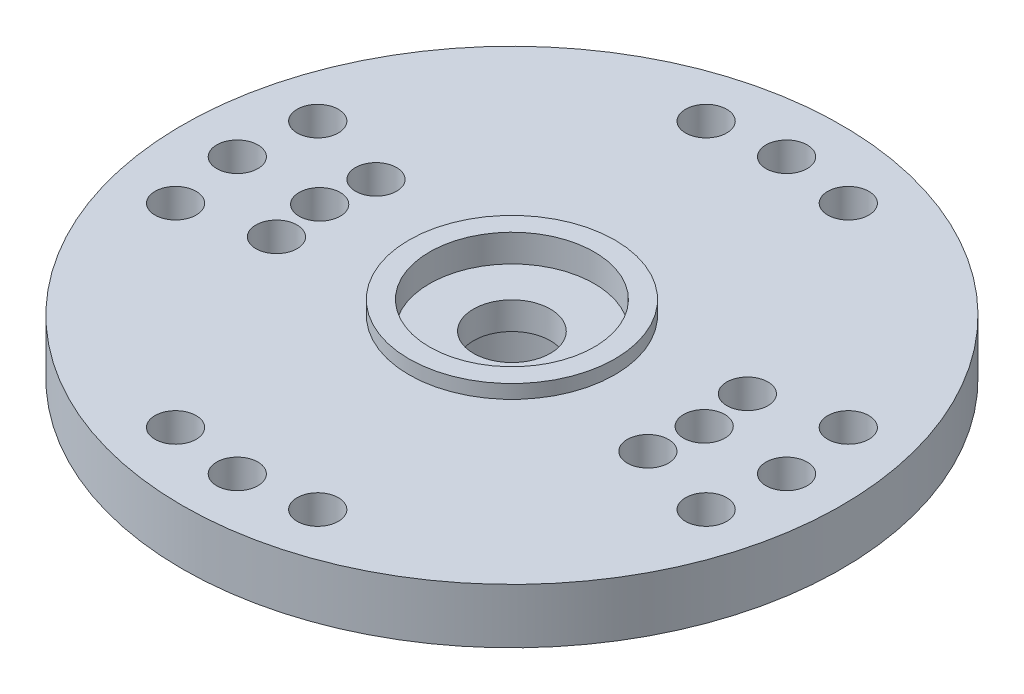
ISO-10303-21;
HEADER;
FILE_DESCRIPTION(('STEP AP214'),'2;1');
FILE_NAME('part.step','',(''),(''),'','','');
FILE_SCHEMA(('AUTOMOTIVE_DESIGN { 1 0 10303 214 1 1 1 1 }'));
ENDSEC;
DATA;
#1=APPLICATION_CONTEXT('core data for automotive mechanical design processes');
#2=APPLICATION_PROTOCOL_DEFINITION('international standard','automotive_design',2000,#1);
#3=PRODUCT_CONTEXT('',#1,'mechanical');
#4=PRODUCT('Part','Part','',(#3));
#5=PRODUCT_RELATED_PRODUCT_CATEGORY('part','',(#4));
#6=PRODUCT_DEFINITION_FORMATION('','',#4);
#7=PRODUCT_DEFINITION_CONTEXT('part definition',#1,'design');
#8=PRODUCT_DEFINITION('design','',#6,#7);
#9=PRODUCT_DEFINITION_SHAPE('','',#8);
#10=(LENGTH_UNIT() NAMED_UNIT(*) SI_UNIT(.MILLI.,.METRE.));
#11=(NAMED_UNIT(*) PLANE_ANGLE_UNIT() SI_UNIT($,.RADIAN.));
#12=(NAMED_UNIT(*) SI_UNIT($,.STERADIAN.) SOLID_ANGLE_UNIT());
#13=UNCERTAINTY_MEASURE_WITH_UNIT(LENGTH_MEASURE(1.E-05),#10,'distance_accuracy_value','');
#14=(GEOMETRIC_REPRESENTATION_CONTEXT(3) GLOBAL_UNCERTAINTY_ASSIGNED_CONTEXT((#13)) GLOBAL_UNIT_ASSIGNED_CONTEXT((#10,
#11,#12)) REPRESENTATION_CONTEXT('',''));
#15=CARTESIAN_POINT('',(0.,0.,0.));
#16=DIRECTION('',(0.,0.,1.));
#17=DIRECTION('',(1.,0.,0.));
#18=AXIS2_PLACEMENT_3D('',#15,#16,#17);
#19=CARTESIAN_POINT('',(0.,0.,0.));
#20=DIRECTION('',(0.,1.,0.));
#21=DIRECTION('',(0.,0.,1.));
#22=AXIS2_PLACEMENT_3D('',#19,#20,#21);
#23=CYLINDRICAL_SURFACE('',#22,1.4);
#24=CARTESIAN_POINT('',(0.,-0.5,0.));
#25=DIRECTION('',(0.,1.,0.));
#26=DIRECTION('',(0.,0.,1.));
#27=AXIS2_PLACEMENT_3D('',#24,#25,#26);
#28=CIRCLE('',#27,1.4);
#29=CARTESIAN_POINT('',(0.,-0.5,1.4));
#30=VERTEX_POINT('',#29);
#31=EDGE_CURVE('E58',#30,#30,#28,.T.);
#32=ORIENTED_EDGE('',*,*,#31,.T.);
#33=EDGE_LOOP('',(#32));
#34=FACE_BOUND('',#33,.T.);
#35=CARTESIAN_POINT('',(0.,-1.5,0.));
#36=DIRECTION('',(0.,-1.,0.));
#37=DIRECTION('',(0.,0.,-1.));
#38=AXIS2_PLACEMENT_3D('',#35,#36,#37);
#39=CIRCLE('',#38,1.4);
#40=CARTESIAN_POINT('',(0.,-1.5,-1.4));
#41=VERTEX_POINT('',#40);
#42=EDGE_CURVE('E42',#41,#41,#39,.T.);
#43=ORIENTED_EDGE('',*,*,#42,.T.);
#44=EDGE_LOOP('',(#43));
#45=FACE_BOUND('',#44,.T.);
#46=ADVANCED_FACE('F38',(#34,#45),#23,.F.);
#47=CARTESIAN_POINT('',(0.,0.,0.));
#48=DIRECTION('',(0.,1.,0.));
#49=DIRECTION('',(0.,0.,1.));
#50=AXIS2_PLACEMENT_3D('',#47,#48,#49);
#51=CYLINDRICAL_SURFACE('',#50,12.);
#52=CARTESIAN_POINT('',(0.,-2.,0.));
#53=DIRECTION('',(0.,1.,0.));
#54=DIRECTION('',(0.,0.,1.));
#55=AXIS2_PLACEMENT_3D('',#52,#53,#54);
#56=CIRCLE('',#55,12.);
#57=CARTESIAN_POINT('',(0.,-2.,12.));
#58=VERTEX_POINT('',#57);
#59=EDGE_CURVE('E10',#58,#58,#56,.T.);
#60=ORIENTED_EDGE('',*,*,#59,.T.);
#61=EDGE_LOOP('',(#60));
#62=FACE_BOUND('',#61,.T.);
#63=CARTESIAN_POINT('',(0.,0.,0.));
#64=DIRECTION('',(0.,1.,0.));
#65=DIRECTION('',(0.,0.,1.));
#66=AXIS2_PLACEMENT_3D('',#63,#64,#65);
#67=CIRCLE('',#66,12.);
#68=CARTESIAN_POINT('',(0.,0.,12.));
#69=VERTEX_POINT('',#68);
#70=EDGE_CURVE('E164',#69,#69,#67,.T.);
#71=ORIENTED_EDGE('',*,*,#70,.F.);
#72=EDGE_LOOP('',(#71));
#73=FACE_BOUND('',#72,.T.);
#74=ADVANCED_FACE('F40',(#62,#73),#51,.T.);
#75=CARTESIAN_POINT('',(-12.,-2.,0.));
#76=DIRECTION('',(0.,-1.,0.));
#77=DIRECTION('',(0.,0.,-1.));
#78=AXIS2_PLACEMENT_3D('',#75,#76,#77);
#79=PLANE('',#78);
#80=CARTESIAN_POINT('',(7.,-2.,0.));
#81=DIRECTION('',(0.,-1.,0.));
#82=DIRECTION('',(0.,0.,1.));
#83=AXIS2_PLACEMENT_3D('',#80,#81,#82);
#84=CIRCLE('',#83,0.749999999999993);
#85=CARTESIAN_POINT('',(7.00000000000001,-2.,0.749999999999944));
#86=VERTEX_POINT('',#85);
#87=EDGE_CURVE('E307',#86,#86,#84,.T.);
#88=ORIENTED_EDGE('',*,*,#87,.F.);
#89=EDGE_LOOP('',(#88));
#90=FACE_BOUND('',#89,.T.);
#91=CARTESIAN_POINT('',(6.76148078402348,-2.,-1.81173331571765));
#92=DIRECTION('',(0.,-1.,0.));
#93=DIRECTION('',(0.,0.,1.));
#94=AXIS2_PLACEMENT_3D('',#91,#92,#93);
#95=CIRCLE('',#94,0.749999999999993);
#96=CARTESIAN_POINT('',(6.76148078402348,-2.,-1.06173331571766));
#97=VERTEX_POINT('',#96);
#98=EDGE_CURVE('E315',#97,#97,#95,.T.);
#99=ORIENTED_EDGE('',*,*,#98,.F.);
#100=EDGE_LOOP('',(#99));
#101=FACE_BOUND('',#100,.T.);
#102=CARTESIAN_POINT('',(6.7614807840235,-2.,1.81173331571755));
#103=DIRECTION('',(0.,-1.,0.));
#104=DIRECTION('',(0.,0.,1.));
#105=AXIS2_PLACEMENT_3D('',#102,#103,#104);
#106=CIRCLE('',#105,0.749999999999993);
#107=CARTESIAN_POINT('',(6.76148078402351,-2.,2.56173331571755));
#108=VERTEX_POINT('',#107);
#109=EDGE_CURVE('E324',#108,#108,#106,.T.);
#110=ORIENTED_EDGE('',*,*,#109,.F.);
#111=EDGE_LOOP('',(#110));
#112=FACE_BOUND('',#111,.T.);
#113=CARTESIAN_POINT('',(-6.76148078402349,-2.,-1.8117333157176));
#114=DIRECTION('',(0.,-1.,0.));
#115=DIRECTION('',(0.,0.,-1.));
#116=AXIS2_PLACEMENT_3D('',#113,#114,#115);
#117=CIRCLE('',#116,0.749999999999993);
#118=CARTESIAN_POINT('',(-6.76148078402349,-2.,-2.56173331571759));
#119=VERTEX_POINT('',#118);
#120=EDGE_CURVE('E331',#119,#119,#117,.T.);
#121=ORIENTED_EDGE('',*,*,#120,.F.);
#122=EDGE_LOOP('',(#121));
#123=FACE_BOUND('',#122,.T.);
#124=CARTESIAN_POINT('',(-7.,-2.,0.));
#125=DIRECTION('',(0.,-1.,0.));
#126=DIRECTION('',(0.,0.,-1.));
#127=AXIS2_PLACEMENT_3D('',#124,#125,#126);
#128=CIRCLE('',#127,0.749999999999993);
#129=CARTESIAN_POINT('',(-7.,-2.,-0.749999999999993));
#130=VERTEX_POINT('',#129);
#131=EDGE_CURVE('E339',#130,#130,#128,.T.);
#132=ORIENTED_EDGE('',*,*,#131,.F.);
#133=EDGE_LOOP('',(#132));
#134=FACE_BOUND('',#133,.T.);
#135=CARTESIAN_POINT('',(-6.76148078402349,-2.,1.8117333157176));
#136=DIRECTION('',(0.,-1.,0.));
#137=DIRECTION('',(0.,0.,-1.));
#138=AXIS2_PLACEMENT_3D('',#135,#136,#137);
#139=CIRCLE('',#138,0.749999999999993);
#140=CARTESIAN_POINT('',(-6.76148078402349,-2.,1.06173331571761));
#141=VERTEX_POINT('',#140);
#142=EDGE_CURVE('E347',#141,#141,#139,.T.);
#143=ORIENTED_EDGE('',*,*,#142,.F.);
#144=EDGE_LOOP('',(#143));
#145=FACE_BOUND('',#144,.T.);
#146=CARTESIAN_POINT('',(-9.65925826289071,-2.,2.58819045102512));
#147=DIRECTION('',(0.,-1.,0.));
#148=DIRECTION('',(-1.,0.,0.));
#149=AXIS2_PLACEMENT_3D('',#146,#147,#148);
#150=CIRCLE('',#149,0.75);
#151=CARTESIAN_POINT('',(-10.4092582628907,-2.,2.58819045102511));
#152=VERTEX_POINT('',#151);
#153=EDGE_CURVE('E68',#152,#152,#150,.T.);
#154=ORIENTED_EDGE('',*,*,#153,.F.);
#155=EDGE_LOOP('',(#154));
#156=FACE_BOUND('',#155,.T.);
#157=CARTESIAN_POINT('',(2.58819045102515,-2.,9.6592582628907));
#158=DIRECTION('',(0.,-1.,0.));
#159=DIRECTION('',(0.,0.,1.));
#160=AXIS2_PLACEMENT_3D('',#157,#158,#159);
#161=CIRCLE('',#160,0.75);
#162=CARTESIAN_POINT('',(2.58819045102514,-2.,10.4092582628907));
#163=VERTEX_POINT('',#162);
#164=EDGE_CURVE('E88',#163,#163,#161,.T.);
#165=ORIENTED_EDGE('',*,*,#164,.F.);
#166=EDGE_LOOP('',(#165));
#167=FACE_BOUND('',#166,.T.);
#168=CARTESIAN_POINT('',(9.65925826289069,-2.,-2.58819045102518));
#169=DIRECTION('',(0.,-1.,0.));
#170=DIRECTION('',(1.,0.,0.));
#171=AXIS2_PLACEMENT_3D('',#168,#169,#170);
#172=CIRCLE('',#171,0.75);
#173=CARTESIAN_POINT('',(10.4092582628907,-2.,-2.58819045102518));
#174=VERTEX_POINT('',#173);
#175=EDGE_CURVE('E95',#174,#174,#172,.T.);
#176=ORIENTED_EDGE('',*,*,#175,.F.);
#177=EDGE_LOOP('',(#176));
#178=FACE_BOUND('',#177,.T.);
#179=CARTESIAN_POINT('',(-9.65925826289065,-2.,-2.58819045102531));
#180=DIRECTION('',(0.,-1.,0.));
#181=DIRECTION('',(-1.,0.,0.));
#182=AXIS2_PLACEMENT_3D('',#179,#180,#181);
#183=CIRCLE('',#182,0.75);
#184=CARTESIAN_POINT('',(-10.4092582628907,-2.,-2.58819045102532));
#185=VERTEX_POINT('',#184);
#186=EDGE_CURVE('E102',#185,#185,#183,.T.);
#187=ORIENTED_EDGE('',*,*,#186,.F.);
#188=EDGE_LOOP('',(#187));
#189=FACE_BOUND('',#188,.T.);
#190=CARTESIAN_POINT('',(-2.58819045102528,-2.,9.65925826289067));
#191=DIRECTION('',(0.,-1.,0.));
#192=DIRECTION('',(0.,0.,1.));
#193=AXIS2_PLACEMENT_3D('',#190,#191,#192);
#194=CIRCLE('',#193,0.75);
#195=CARTESIAN_POINT('',(-2.58819045102529,-2.,10.4092582628907));
#196=VERTEX_POINT('',#195);
#197=EDGE_CURVE('E109',#196,#196,#194,.T.);
#198=ORIENTED_EDGE('',*,*,#197,.F.);
#199=EDGE_LOOP('',(#198));
#200=FACE_BOUND('',#199,.T.);
#201=CARTESIAN_POINT('',(9.65925826289067,-2.,2.58819045102525));
#202=DIRECTION('',(0.,-1.,0.));
#203=DIRECTION('',(1.,0.,0.));
#204=AXIS2_PLACEMENT_3D('',#201,#202,#203);
#205=CIRCLE('',#204,0.75);
#206=CARTESIAN_POINT('',(10.4092582628907,-2.,2.58819045102525));
#207=VERTEX_POINT('',#206);
#208=EDGE_CURVE('E117',#207,#207,#205,.T.);
#209=ORIENTED_EDGE('',*,*,#208,.F.);
#210=EDGE_LOOP('',(#209));
#211=FACE_BOUND('',#210,.T.);
#212=CARTESIAN_POINT('',(-10.,-2.,-1.04744500833281E-13));
#213=DIRECTION('',(0.,-1.,0.));
#214=DIRECTION('',(-1.,0.,0.));
#215=AXIS2_PLACEMENT_3D('',#212,#213,#214);
#216=CIRCLE('',#215,0.75);
#217=CARTESIAN_POINT('',(-10.75,-2.,-1.12600338395778E-13));
#218=VERTEX_POINT('',#217);
#219=EDGE_CURVE('E123',#218,#218,#216,.T.);
#220=ORIENTED_EDGE('',*,*,#219,.F.);
#221=EDGE_LOOP('',(#220));
#222=FACE_BOUND('',#221,.T.);
#223=CARTESIAN_POINT('',(0.,-2.,10.));
#224=DIRECTION('',(0.,-1.,0.));
#225=DIRECTION('',(0.,0.,1.));
#226=AXIS2_PLACEMENT_3D('',#223,#224,#225);
#227=CIRCLE('',#226,0.75);
#228=CARTESIAN_POINT('',(0.,-2.,10.75));
#229=VERTEX_POINT('',#228);
#230=EDGE_CURVE('E130',#229,#229,#227,.T.);
#231=ORIENTED_EDGE('',*,*,#230,.F.);
#232=EDGE_LOOP('',(#231));
#233=FACE_BOUND('',#232,.T.);
#234=CARTESIAN_POINT('',(10.,-2.,0.));
#235=DIRECTION('',(0.,-1.,0.));
#236=DIRECTION('',(1.,0.,0.));
#237=AXIS2_PLACEMENT_3D('',#234,#235,#236);
#238=CIRCLE('',#237,0.75);
#239=CARTESIAN_POINT('',(10.75,-2.,0.));
#240=VERTEX_POINT('',#239);
#241=EDGE_CURVE('E138',#240,#240,#238,.T.);
#242=ORIENTED_EDGE('',*,*,#241,.F.);
#243=EDGE_LOOP('',(#242));
#244=FACE_BOUND('',#243,.T.);
#245=CARTESIAN_POINT('',(0.,-2.,-10.));
#246=DIRECTION('',(0.,-1.,0.));
#247=DIRECTION('',(0.,0.,-1.));
#248=AXIS2_PLACEMENT_3D('',#245,#246,#247);
#249=CIRCLE('',#248,0.75);
#250=CARTESIAN_POINT('',(0.,-2.,-10.75));
#251=VERTEX_POINT('',#250);
#252=EDGE_CURVE('E146',#251,#251,#249,.T.);
#253=ORIENTED_EDGE('',*,*,#252,.F.);
#254=EDGE_LOOP('',(#253));
#255=FACE_BOUND('',#254,.T.);
#256=CARTESIAN_POINT('',(-2.58819045102522,-2.,-9.65925826289068));
#257=DIRECTION('',(0.,-1.,0.));
#258=DIRECTION('',(0.,0.,-1.));
#259=AXIS2_PLACEMENT_3D('',#256,#257,#258);
#260=CIRCLE('',#259,0.75);
#261=CARTESIAN_POINT('',(-2.58819045102522,-2.,-10.4092582628907));
#262=VERTEX_POINT('',#261);
#263=EDGE_CURVE('E153',#262,#262,#260,.T.);
#264=ORIENTED_EDGE('',*,*,#263,.F.);
#265=EDGE_LOOP('',(#264));
#266=FACE_BOUND('',#265,.T.);
#267=CARTESIAN_POINT('',(2.58819045102521,-2.,-9.65925826289068));
#268=DIRECTION('',(0.,-1.,0.));
#269=DIRECTION('',(0.,0.,-1.));
#270=AXIS2_PLACEMENT_3D('',#267,#268,#269);
#271=CIRCLE('',#270,0.75);
#272=CARTESIAN_POINT('',(2.58819045102521,-2.,-10.4092582628907));
#273=VERTEX_POINT('',#272);
#274=EDGE_CURVE('E160',#273,#273,#271,.T.);
#275=ORIENTED_EDGE('',*,*,#274,.F.);
#276=EDGE_LOOP('',(#275));
#277=FACE_BOUND('',#276,.T.);
#278=CARTESIAN_POINT('',(0.,-2.,0.));
#279=DIRECTION('',(0.,1.,0.));
#280=DIRECTION('',(0.,0.,1.));
#281=AXIS2_PLACEMENT_3D('',#278,#279,#280);
#282=CIRCLE('',#281,4.45);
#283=CARTESIAN_POINT('',(0.,-2.,4.45));
#284=VERTEX_POINT('',#283);
#285=EDGE_CURVE('E47',#284,#284,#282,.T.);
#286=ORIENTED_EDGE('',*,*,#285,.T.);
#287=EDGE_LOOP('',(#286));
#288=FACE_BOUND('',#287,.T.);
#289=ORIENTED_EDGE('',*,*,#59,.F.);
#290=EDGE_LOOP('',(#289));
#291=FACE_BOUND('',#290,.T.);
#292=ADVANCED_FACE('F195',(#90,#101,#112,#123,#134,#145,#156,#167,#178,#189,#200,#211,#222,#233,
#244,#255,#266,#277,#288,#291),#79,.T.);
#293=CARTESIAN_POINT('',(0.,0.,0.));
#294=DIRECTION('',(0.,1.,0.));
#295=DIRECTION('',(0.,0.,1.));
#296=AXIS2_PLACEMENT_3D('',#293,#294,#295);
#297=CYLINDRICAL_SURFACE('',#296,4.45);
#298=CARTESIAN_POINT('',(0.,-4.5,0.));
#299=DIRECTION('',(0.,1.,0.));
#300=DIRECTION('',(0.,0.,1.));
#301=AXIS2_PLACEMENT_3D('',#298,#299,#300);
#302=CIRCLE('',#301,4.45);
#303=CARTESIAN_POINT('',(0.,-4.5,4.45));
#304=VERTEX_POINT('',#303);
#305=EDGE_CURVE('E55',#304,#304,#302,.T.);
#306=ORIENTED_EDGE('',*,*,#305,.T.);
#307=EDGE_LOOP('',(#306));
#308=FACE_BOUND('',#307,.T.);
#309=ORIENTED_EDGE('',*,*,#285,.F.);
#310=EDGE_LOOP('',(#309));
#311=FACE_BOUND('',#310,.T.);
#312=ADVANCED_FACE('F180',(#308,#311),#297,.T.);
#313=CARTESIAN_POINT('',(-4.45,-4.5,0.));
#314=DIRECTION('',(0.,-1.,0.));
#315=DIRECTION('',(0.,0.,-1.));
#316=AXIS2_PLACEMENT_3D('',#313,#314,#315);
#317=PLANE('',#316);
#318=CARTESIAN_POINT('',(0.,-4.5,0.));
#319=DIRECTION('',(0.,-1.,0.));
#320=DIRECTION('',(0.,0.,-1.));
#321=AXIS2_PLACEMENT_3D('',#318,#319,#320);
#322=CIRCLE('',#321,3.);
#323=CARTESIAN_POINT('',(0.,-4.5,-3.));
#324=VERTEX_POINT('',#323);
#325=EDGE_CURVE('E351',#324,#324,#322,.T.);
#326=ORIENTED_EDGE('',*,*,#325,.F.);
#327=EDGE_LOOP('',(#326));
#328=FACE_BOUND('',#327,.T.);
#329=ORIENTED_EDGE('',*,*,#305,.F.);
#330=EDGE_LOOP('',(#329));
#331=FACE_BOUND('',#330,.T.);
#332=ADVANCED_FACE('F183',(#328,#331),#317,.T.);
#333=CARTESIAN_POINT('',(-3.75,0.5,0.));
#334=DIRECTION('',(0.,1.,0.));
#335=DIRECTION('',(0.,0.,1.));
#336=AXIS2_PLACEMENT_3D('',#333,#334,#335);
#337=PLANE('',#336);
#338=CARTESIAN_POINT('',(0.,0.5,0.));
#339=DIRECTION('',(0.,1.,0.));
#340=DIRECTION('',(0.,0.,1.));
#341=AXIS2_PLACEMENT_3D('',#338,#339,#340);
#342=CIRCLE('',#341,3.);
#343=CARTESIAN_POINT('',(0.,0.5,3.));
#344=VERTEX_POINT('',#343);
#345=EDGE_CURVE('E72',#344,#344,#342,.T.);
#346=ORIENTED_EDGE('',*,*,#345,.F.);
#347=EDGE_LOOP('',(#346));
#348=FACE_BOUND('',#347,.T.);
#349=CARTESIAN_POINT('',(0.,0.5,0.));
#350=DIRECTION('',(0.,1.,0.));
#351=DIRECTION('',(0.,0.,1.));
#352=AXIS2_PLACEMENT_3D('',#349,#350,#351);
#353=CIRCLE('',#352,3.75);
#354=CARTESIAN_POINT('',(0.,0.5,3.75));
#355=VERTEX_POINT('',#354);
#356=EDGE_CURVE('E172',#355,#355,#353,.T.);
#357=ORIENTED_EDGE('',*,*,#356,.T.);
#358=EDGE_LOOP('',(#357));
#359=FACE_BOUND('',#358,.T.);
#360=ADVANCED_FACE('F185',(#348,#359),#337,.T.);
#361=CARTESIAN_POINT('',(0.,0.,0.));
#362=DIRECTION('',(0.,1.,0.));
#363=DIRECTION('',(0.,0.,1.));
#364=AXIS2_PLACEMENT_3D('',#361,#362,#363);
#365=CYLINDRICAL_SURFACE('',#364,3.75);
#366=CARTESIAN_POINT('',(0.,0.,0.));
#367=DIRECTION('',(0.,1.,0.));
#368=DIRECTION('',(0.,0.,1.));
#369=AXIS2_PLACEMENT_3D('',#366,#367,#368);
#370=CIRCLE('',#369,3.75);
#371=CARTESIAN_POINT('',(0.,0.,3.75));
#372=VERTEX_POINT('',#371);
#373=EDGE_CURVE('E168',#372,#372,#370,.T.);
#374=ORIENTED_EDGE('',*,*,#373,.T.);
#375=EDGE_LOOP('',(#374));
#376=FACE_BOUND('',#375,.T.);
#377=ORIENTED_EDGE('',*,*,#356,.F.);
#378=EDGE_LOOP('',(#377));
#379=FACE_BOUND('',#378,.T.);
#380=ADVANCED_FACE('F192',(#376,#379),#365,.T.);
#381=CARTESIAN_POINT('',(-12.,0.,0.));
#382=DIRECTION('',(0.,1.,0.));
#383=DIRECTION('',(0.,0.,1.));
#384=AXIS2_PLACEMENT_3D('',#381,#382,#383);
#385=PLANE('',#384);
#386=CARTESIAN_POINT('',(7.,0.,0.));
#387=DIRECTION('',(0.,1.,0.));
#388=DIRECTION('',(0.,0.,-1.));
#389=AXIS2_PLACEMENT_3D('',#386,#387,#388);
#390=CIRCLE('',#389,0.749999999999987);
#391=CARTESIAN_POINT('',(6.99999999999999,0.,-0.750000000000036));
#392=VERTEX_POINT('',#391);
#393=EDGE_CURVE('E304',#392,#392,#390,.T.);
#394=ORIENTED_EDGE('',*,*,#393,.F.);
#395=EDGE_LOOP('',(#394));
#396=FACE_BOUND('',#395,.T.);
#397=CARTESIAN_POINT('',(6.76148078402348,0.,-1.81173331571765));
#398=DIRECTION('',(0.,1.,0.));
#399=DIRECTION('',(0.,0.,-1.));
#400=AXIS2_PLACEMENT_3D('',#397,#398,#399);
#401=CIRCLE('',#400,0.749999999999987);
#402=CARTESIAN_POINT('',(6.76148078402347,0.,-2.56173331571764));
#403=VERTEX_POINT('',#402);
#404=EDGE_CURVE('E310',#403,#403,#401,.T.);
#405=ORIENTED_EDGE('',*,*,#404,.F.);
#406=EDGE_LOOP('',(#405));
#407=FACE_BOUND('',#406,.T.);
#408=CARTESIAN_POINT('',(6.7614807840235,0.,1.81173331571755));
#409=DIRECTION('',(0.,1.,0.));
#410=DIRECTION('',(0.,0.,-1.));
#411=AXIS2_PLACEMENT_3D('',#408,#409,#410);
#412=CIRCLE('',#411,0.749999999999987);
#413=CARTESIAN_POINT('',(6.7614807840235,0.,1.06173331571757));
#414=VERTEX_POINT('',#413);
#415=EDGE_CURVE('E321',#414,#414,#412,.T.);
#416=ORIENTED_EDGE('',*,*,#415,.F.);
#417=EDGE_LOOP('',(#416));
#418=FACE_BOUND('',#417,.T.);
#419=CARTESIAN_POINT('',(-6.76148078402349,0.,-1.8117333157176));
#420=DIRECTION('',(0.,1.,0.));
#421=DIRECTION('',(0.,0.,1.));
#422=AXIS2_PLACEMENT_3D('',#419,#420,#421);
#423=CIRCLE('',#422,0.749999999999987);
#424=CARTESIAN_POINT('',(-6.76148078402349,0.,-1.06173331571761));
#425=VERTEX_POINT('',#424);
#426=EDGE_CURVE('E327',#425,#425,#423,.T.);
#427=ORIENTED_EDGE('',*,*,#426,.F.);
#428=EDGE_LOOP('',(#427));
#429=FACE_BOUND('',#428,.T.);
#430=CARTESIAN_POINT('',(-7.,0.,0.));
#431=DIRECTION('',(0.,1.,0.));
#432=DIRECTION('',(0.,0.,1.));
#433=AXIS2_PLACEMENT_3D('',#430,#431,#432);
#434=CIRCLE('',#433,0.749999999999987);
#435=CARTESIAN_POINT('',(-7.,0.,0.749999999999987));
#436=VERTEX_POINT('',#435);
#437=EDGE_CURVE('E335',#436,#436,#434,.T.);
#438=ORIENTED_EDGE('',*,*,#437,.F.);
#439=EDGE_LOOP('',(#438));
#440=FACE_BOUND('',#439,.T.);
#441=CARTESIAN_POINT('',(-6.76148078402349,0.,1.8117333157176));
#442=DIRECTION('',(0.,1.,0.));
#443=DIRECTION('',(0.,0.,1.));
#444=AXIS2_PLACEMENT_3D('',#441,#442,#443);
#445=CIRCLE('',#444,0.749999999999987);
#446=CARTESIAN_POINT('',(-6.76148078402349,0.,2.56173331571759));
#447=VERTEX_POINT('',#446);
#448=EDGE_CURVE('E343',#447,#447,#445,.T.);
#449=ORIENTED_EDGE('',*,*,#448,.F.);
#450=EDGE_LOOP('',(#449));
#451=FACE_BOUND('',#450,.T.);
#452=CARTESIAN_POINT('',(-9.65925826289071,0.,2.58819045102512));
#453=DIRECTION('',(0.,1.,0.));
#454=DIRECTION('',(1.,0.,0.));
#455=AXIS2_PLACEMENT_3D('',#452,#453,#454);
#456=CIRCLE('',#455,0.75);
#457=CARTESIAN_POINT('',(-8.90925826289071,0.,2.58819045102512));
#458=VERTEX_POINT('',#457);
#459=EDGE_CURVE('E61',#458,#458,#456,.T.);
#460=ORIENTED_EDGE('',*,*,#459,.F.);
#461=EDGE_LOOP('',(#460));
#462=FACE_BOUND('',#461,.T.);
#463=CARTESIAN_POINT('',(2.58819045102515,0.,9.6592582628907));
#464=DIRECTION('',(0.,1.,0.));
#465=DIRECTION('',(0.,0.,-1.));
#466=AXIS2_PLACEMENT_3D('',#463,#464,#465);
#467=CIRCLE('',#466,0.75);
#468=CARTESIAN_POINT('',(2.58819045102516,0.,8.9092582628907));
#469=VERTEX_POINT('',#468);
#470=EDGE_CURVE('E84',#469,#469,#467,.T.);
#471=ORIENTED_EDGE('',*,*,#470,.F.);
#472=EDGE_LOOP('',(#471));
#473=FACE_BOUND('',#472,.T.);
#474=CARTESIAN_POINT('',(9.65925826289069,0.,-2.58819045102518));
#475=DIRECTION('',(0.,1.,0.));
#476=DIRECTION('',(-1.,0.,0.));
#477=AXIS2_PLACEMENT_3D('',#474,#475,#476);
#478=CIRCLE('',#477,0.75);
#479=CARTESIAN_POINT('',(8.90925826289069,0.,-2.58819045102519));
#480=VERTEX_POINT('',#479);
#481=EDGE_CURVE('E91',#480,#480,#478,.T.);
#482=ORIENTED_EDGE('',*,*,#481,.F.);
#483=EDGE_LOOP('',(#482));
#484=FACE_BOUND('',#483,.T.);
#485=CARTESIAN_POINT('',(-9.65925826289065,0.,-2.58819045102531));
#486=DIRECTION('',(0.,1.,0.));
#487=DIRECTION('',(1.,0.,0.));
#488=AXIS2_PLACEMENT_3D('',#485,#486,#487);
#489=CIRCLE('',#488,0.75);
#490=CARTESIAN_POINT('',(-8.90925826289065,0.,-2.58819045102531));
#491=VERTEX_POINT('',#490);
#492=EDGE_CURVE('E99',#491,#491,#489,.T.);
#493=ORIENTED_EDGE('',*,*,#492,.F.);
#494=EDGE_LOOP('',(#493));
#495=FACE_BOUND('',#494,.T.);
#496=CARTESIAN_POINT('',(-2.58819045102528,0.,9.65925826289067));
#497=DIRECTION('',(0.,1.,0.));
#498=DIRECTION('',(0.,0.,-1.));
#499=AXIS2_PLACEMENT_3D('',#496,#497,#498);
#500=CIRCLE('',#499,0.75);
#501=CARTESIAN_POINT('',(-2.58819045102527,0.,8.90925826289066));
#502=VERTEX_POINT('',#501);
#503=EDGE_CURVE('E105',#502,#502,#500,.T.);
#504=ORIENTED_EDGE('',*,*,#503,.F.);
#505=EDGE_LOOP('',(#504));
#506=FACE_BOUND('',#505,.T.);
#507=CARTESIAN_POINT('',(9.65925826289067,0.,2.58819045102525));
#508=DIRECTION('',(0.,1.,0.));
#509=DIRECTION('',(-1.,0.,0.));
#510=AXIS2_PLACEMENT_3D('',#507,#508,#509);
#511=CIRCLE('',#510,0.75);
#512=CARTESIAN_POINT('',(8.90925826289067,0.,2.58819045102524));
#513=VERTEX_POINT('',#512);
#514=EDGE_CURVE('E113',#513,#513,#511,.T.);
#515=ORIENTED_EDGE('',*,*,#514,.F.);
#516=EDGE_LOOP('',(#515));
#517=FACE_BOUND('',#516,.T.);
#518=CARTESIAN_POINT('',(-10.,0.,-1.04744500833281E-13));
#519=DIRECTION('',(0.,1.,0.));
#520=DIRECTION('',(1.,0.,0.));
#521=AXIS2_PLACEMENT_3D('',#518,#519,#520);
#522=CIRCLE('',#521,0.75);
#523=CARTESIAN_POINT('',(-9.25,0.,0.));
#524=VERTEX_POINT('',#523);
#525=EDGE_CURVE('E120',#524,#524,#522,.T.);
#526=ORIENTED_EDGE('',*,*,#525,.F.);
#527=EDGE_LOOP('',(#526));
#528=FACE_BOUND('',#527,.T.);
#529=CARTESIAN_POINT('',(0.,0.,10.));
#530=DIRECTION('',(0.,1.,0.));
#531=DIRECTION('',(0.,0.,-1.));
#532=AXIS2_PLACEMENT_3D('',#529,#530,#531);
#533=CIRCLE('',#532,0.75);
#534=CARTESIAN_POINT('',(0.,0.,9.25));
#535=VERTEX_POINT('',#534);
#536=EDGE_CURVE('E126',#535,#535,#533,.T.);
#537=ORIENTED_EDGE('',*,*,#536,.F.);
#538=EDGE_LOOP('',(#537));
#539=FACE_BOUND('',#538,.T.);
#540=CARTESIAN_POINT('',(10.,0.,0.));
#541=DIRECTION('',(0.,1.,0.));
#542=DIRECTION('',(-1.,0.,0.));
#543=AXIS2_PLACEMENT_3D('',#540,#541,#542);
#544=CIRCLE('',#543,0.75);
#545=CARTESIAN_POINT('',(9.25,0.,0.));
#546=VERTEX_POINT('',#545);
#547=EDGE_CURVE('E134',#546,#546,#544,.T.);
#548=ORIENTED_EDGE('',*,*,#547,.F.);
#549=EDGE_LOOP('',(#548));
#550=FACE_BOUND('',#549,.T.);
#551=CARTESIAN_POINT('',(0.,0.,-10.));
#552=DIRECTION('',(0.,1.,0.));
#553=DIRECTION('',(0.,0.,1.));
#554=AXIS2_PLACEMENT_3D('',#551,#552,#553);
#555=CIRCLE('',#554,0.75);
#556=CARTESIAN_POINT('',(0.,0.,-9.25));
#557=VERTEX_POINT('',#556);
#558=EDGE_CURVE('E142',#557,#557,#555,.T.);
#559=ORIENTED_EDGE('',*,*,#558,.F.);
#560=EDGE_LOOP('',(#559));
#561=FACE_BOUND('',#560,.T.);
#562=CARTESIAN_POINT('',(-2.58819045102522,0.,-9.65925826289068));
#563=DIRECTION('',(0.,1.,0.));
#564=DIRECTION('',(0.,0.,1.));
#565=AXIS2_PLACEMENT_3D('',#562,#563,#564);
#566=CIRCLE('',#565,0.75);
#567=CARTESIAN_POINT('',(-2.58819045102522,0.,-8.90925826289068));
#568=VERTEX_POINT('',#567);
#569=EDGE_CURVE('E149',#568,#568,#566,.T.);
#570=ORIENTED_EDGE('',*,*,#569,.F.);
#571=EDGE_LOOP('',(#570));
#572=FACE_BOUND('',#571,.T.);
#573=CARTESIAN_POINT('',(2.58819045102521,0.,-9.65925826289068));
#574=DIRECTION('',(0.,1.,0.));
#575=DIRECTION('',(0.,0.,1.));
#576=AXIS2_PLACEMENT_3D('',#573,#574,#575);
#577=CIRCLE('',#576,0.75);
#578=CARTESIAN_POINT('',(2.58819045102521,0.,-8.90925826289068));
#579=VERTEX_POINT('',#578);
#580=EDGE_CURVE('E156',#579,#579,#577,.T.);
#581=ORIENTED_EDGE('',*,*,#580,.F.);
#582=EDGE_LOOP('',(#581));
#583=FACE_BOUND('',#582,.T.);
#584=ORIENTED_EDGE('',*,*,#70,.T.);
#585=EDGE_LOOP('',(#584));
#586=FACE_BOUND('',#585,.T.);
#587=ORIENTED_EDGE('',*,*,#373,.F.);
#588=EDGE_LOOP('',(#587));
#589=FACE_BOUND('',#588,.T.);
#590=ADVANCED_FACE('F207',(#396,#407,#418,#429,#440,#451,#462,#473,#484,#495,#506,#517,#528,
#539,#550,#561,#572,#583,#586,#589),#385,.T.);
#591=CARTESIAN_POINT('',(2.58819045102521,0.,-9.65925826289068));
#592=DIRECTION('',(0.,1.,0.));
#593=DIRECTION('',(0.,0.,1.));
#594=AXIS2_PLACEMENT_3D('',#591,#592,#593);
#595=CYLINDRICAL_SURFACE('',#594,0.75);
#596=ORIENTED_EDGE('',*,*,#580,.T.);
#597=EDGE_LOOP('',(#596));
#598=FACE_BOUND('',#597,.T.);
#599=ORIENTED_EDGE('',*,*,#274,.T.);
#600=EDGE_LOOP('',(#599));
#601=FACE_BOUND('',#600,.T.);
#602=ADVANCED_FACE('F211',(#598,#601),#595,.F.);
#603=CARTESIAN_POINT('',(-2.58819045102522,0.,-9.65925826289068));
#604=DIRECTION('',(0.,1.,0.));
#605=DIRECTION('',(0.,0.,1.));
#606=AXIS2_PLACEMENT_3D('',#603,#604,#605);
#607=CYLINDRICAL_SURFACE('',#606,0.75);
#608=ORIENTED_EDGE('',*,*,#569,.T.);
#609=EDGE_LOOP('',(#608));
#610=FACE_BOUND('',#609,.T.);
#611=ORIENTED_EDGE('',*,*,#263,.T.);
#612=EDGE_LOOP('',(#611));
#613=FACE_BOUND('',#612,.T.);
#614=ADVANCED_FACE('F215',(#610,#613),#607,.F.);
#615=CARTESIAN_POINT('',(0.,0.,-10.));
#616=DIRECTION('',(0.,1.,0.));
#617=DIRECTION('',(0.,0.,1.));
#618=AXIS2_PLACEMENT_3D('',#615,#616,#617);
#619=CYLINDRICAL_SURFACE('',#618,0.75);
#620=ORIENTED_EDGE('',*,*,#558,.T.);
#621=EDGE_LOOP('',(#620));
#622=FACE_BOUND('',#621,.T.);
#623=ORIENTED_EDGE('',*,*,#252,.T.);
#624=EDGE_LOOP('',(#623));
#625=FACE_BOUND('',#624,.T.);
#626=ADVANCED_FACE('F219',(#622,#625),#619,.F.);
#627=CARTESIAN_POINT('',(10.,0.,0.));
#628=DIRECTION('',(0.,1.,0.));
#629=DIRECTION('',(-1.,0.,0.));
#630=AXIS2_PLACEMENT_3D('',#627,#628,#629);
#631=CYLINDRICAL_SURFACE('',#630,0.75);
#632=ORIENTED_EDGE('',*,*,#547,.T.);
#633=EDGE_LOOP('',(#632));
#634=FACE_BOUND('',#633,.T.);
#635=ORIENTED_EDGE('',*,*,#241,.T.);
#636=EDGE_LOOP('',(#635));
#637=FACE_BOUND('',#636,.T.);
#638=ADVANCED_FACE('F223',(#634,#637),#631,.F.);
#639=CARTESIAN_POINT('',(0.,0.,10.));
#640=DIRECTION('',(0.,1.,0.));
#641=DIRECTION('',(0.,0.,-1.));
#642=AXIS2_PLACEMENT_3D('',#639,#640,#641);
#643=CYLINDRICAL_SURFACE('',#642,0.75);
#644=ORIENTED_EDGE('',*,*,#536,.T.);
#645=EDGE_LOOP('',(#644));
#646=FACE_BOUND('',#645,.T.);
#647=ORIENTED_EDGE('',*,*,#230,.T.);
#648=EDGE_LOOP('',(#647));
#649=FACE_BOUND('',#648,.T.);
#650=ADVANCED_FACE('F227',(#646,#649),#643,.F.);
#651=CARTESIAN_POINT('',(-10.,0.,-1.04744500833281E-13));
#652=DIRECTION('',(0.,1.,0.));
#653=DIRECTION('',(1.,0.,0.));
#654=AXIS2_PLACEMENT_3D('',#651,#652,#653);
#655=CYLINDRICAL_SURFACE('',#654,0.75);
#656=ORIENTED_EDGE('',*,*,#525,.T.);
#657=EDGE_LOOP('',(#656));
#658=FACE_BOUND('',#657,.T.);
#659=ORIENTED_EDGE('',*,*,#219,.T.);
#660=EDGE_LOOP('',(#659));
#661=FACE_BOUND('',#660,.T.);
#662=ADVANCED_FACE('F231',(#658,#661),#655,.F.);
#663=CARTESIAN_POINT('',(9.65925826289067,0.,2.58819045102525));
#664=DIRECTION('',(0.,1.,0.));
#665=DIRECTION('',(-1.,0.,0.));
#666=AXIS2_PLACEMENT_3D('',#663,#664,#665);
#667=CYLINDRICAL_SURFACE('',#666,0.75);
#668=ORIENTED_EDGE('',*,*,#514,.T.);
#669=EDGE_LOOP('',(#668));
#670=FACE_BOUND('',#669,.T.);
#671=ORIENTED_EDGE('',*,*,#208,.T.);
#672=EDGE_LOOP('',(#671));
#673=FACE_BOUND('',#672,.T.);
#674=ADVANCED_FACE('F235',(#670,#673),#667,.F.);
#675=CARTESIAN_POINT('',(-2.58819045102528,0.,9.65925826289067));
#676=DIRECTION('',(0.,1.,0.));
#677=DIRECTION('',(0.,0.,-1.));
#678=AXIS2_PLACEMENT_3D('',#675,#676,#677);
#679=CYLINDRICAL_SURFACE('',#678,0.75);
#680=ORIENTED_EDGE('',*,*,#503,.T.);
#681=EDGE_LOOP('',(#680));
#682=FACE_BOUND('',#681,.T.);
#683=ORIENTED_EDGE('',*,*,#197,.T.);
#684=EDGE_LOOP('',(#683));
#685=FACE_BOUND('',#684,.T.);
#686=ADVANCED_FACE('F239',(#682,#685),#679,.F.);
#687=CARTESIAN_POINT('',(-9.65925826289065,0.,-2.58819045102531));
#688=DIRECTION('',(0.,1.,0.));
#689=DIRECTION('',(1.,0.,0.));
#690=AXIS2_PLACEMENT_3D('',#687,#688,#689);
#691=CYLINDRICAL_SURFACE('',#690,0.75);
#692=ORIENTED_EDGE('',*,*,#492,.T.);
#693=EDGE_LOOP('',(#692));
#694=FACE_BOUND('',#693,.T.);
#695=ORIENTED_EDGE('',*,*,#186,.T.);
#696=EDGE_LOOP('',(#695));
#697=FACE_BOUND('',#696,.T.);
#698=ADVANCED_FACE('F243',(#694,#697),#691,.F.);
#699=CARTESIAN_POINT('',(9.65925826289069,0.,-2.58819045102518));
#700=DIRECTION('',(0.,1.,0.));
#701=DIRECTION('',(-1.,0.,0.));
#702=AXIS2_PLACEMENT_3D('',#699,#700,#701);
#703=CYLINDRICAL_SURFACE('',#702,0.75);
#704=ORIENTED_EDGE('',*,*,#481,.T.);
#705=EDGE_LOOP('',(#704));
#706=FACE_BOUND('',#705,.T.);
#707=ORIENTED_EDGE('',*,*,#175,.T.);
#708=EDGE_LOOP('',(#707));
#709=FACE_BOUND('',#708,.T.);
#710=ADVANCED_FACE('F247',(#706,#709),#703,.F.);
#711=CARTESIAN_POINT('',(2.58819045102515,0.,9.6592582628907));
#712=DIRECTION('',(0.,1.,0.));
#713=DIRECTION('',(0.,0.,-1.));
#714=AXIS2_PLACEMENT_3D('',#711,#712,#713);
#715=CYLINDRICAL_SURFACE('',#714,0.75);
#716=ORIENTED_EDGE('',*,*,#470,.T.);
#717=EDGE_LOOP('',(#716));
#718=FACE_BOUND('',#717,.T.);
#719=ORIENTED_EDGE('',*,*,#164,.T.);
#720=EDGE_LOOP('',(#719));
#721=FACE_BOUND('',#720,.T.);
#722=ADVANCED_FACE('F251',(#718,#721),#715,.F.);
#723=CARTESIAN_POINT('',(-9.65925826289071,0.,2.58819045102512));
#724=DIRECTION('',(0.,1.,0.));
#725=DIRECTION('',(1.,0.,0.));
#726=AXIS2_PLACEMENT_3D('',#723,#724,#725);
#727=CYLINDRICAL_SURFACE('',#726,0.75);
#728=ORIENTED_EDGE('',*,*,#459,.T.);
#729=EDGE_LOOP('',(#728));
#730=FACE_BOUND('',#729,.T.);
#731=ORIENTED_EDGE('',*,*,#153,.T.);
#732=EDGE_LOOP('',(#731));
#733=FACE_BOUND('',#732,.T.);
#734=ADVANCED_FACE('F255',(#730,#733),#727,.F.);
#735=CARTESIAN_POINT('',(0.,-0.5,0.));
#736=DIRECTION('',(0.,1.,0.));
#737=DIRECTION('',(0.,0.,1.));
#738=AXIS2_PLACEMENT_3D('',#735,#736,#737);
#739=CYLINDRICAL_SURFACE('',#738,3.);
#740=CARTESIAN_POINT('',(0.,-0.5,0.));
#741=DIRECTION('',(0.,1.,0.));
#742=DIRECTION('',(0.,0.,1.));
#743=AXIS2_PLACEMENT_3D('',#740,#741,#742);
#744=CIRCLE('',#743,3.);
#745=CARTESIAN_POINT('',(0.,-0.5,3.));
#746=VERTEX_POINT('',#745);
#747=EDGE_CURVE('E62',#746,#746,#744,.T.);
#748=ORIENTED_EDGE('',*,*,#747,.F.);
#749=EDGE_LOOP('',(#748));
#750=FACE_BOUND('',#749,.T.);
#751=ORIENTED_EDGE('',*,*,#345,.T.);
#752=EDGE_LOOP('',(#751));
#753=FACE_BOUND('',#752,.T.);
#754=ADVANCED_FACE('F259',(#750,#753),#739,.F.);
#755=CARTESIAN_POINT('',(0.,-0.5,0.));
#756=DIRECTION('',(0.,1.,0.));
#757=DIRECTION('',(0.,0.,1.));
#758=AXIS2_PLACEMENT_3D('',#755,#756,#757);
#759=PLANE('',#758);
#760=ORIENTED_EDGE('',*,*,#31,.F.);
#761=EDGE_LOOP('',(#760));
#762=FACE_BOUND('',#761,.T.);
#763=ORIENTED_EDGE('',*,*,#747,.T.);
#764=EDGE_LOOP('',(#763));
#765=FACE_BOUND('',#764,.T.);
#766=ADVANCED_FACE('F263',(#762,#765),#759,.T.);
#767=CARTESIAN_POINT('',(0.,-1.5,0.));
#768=DIRECTION('',(0.,-1.,0.));
#769=DIRECTION('',(0.,0.,-1.));
#770=AXIS2_PLACEMENT_3D('',#767,#768,#769);
#771=CYLINDRICAL_SURFACE('',#770,3.);
#772=CARTESIAN_POINT('',(0.,-1.5,0.));
#773=DIRECTION('',(0.,-1.,0.));
#774=DIRECTION('',(0.,0.,-1.));
#775=AXIS2_PLACEMENT_3D('',#772,#773,#774);
#776=CIRCLE('',#775,3.);
#777=CARTESIAN_POINT('',(0.,-1.5,-3.));
#778=VERTEX_POINT('',#777);
#779=EDGE_CURVE('E353',#778,#778,#776,.T.);
#780=ORIENTED_EDGE('',*,*,#779,.F.);
#781=EDGE_LOOP('',(#780));
#782=FACE_BOUND('',#781,.T.);
#783=ORIENTED_EDGE('',*,*,#325,.T.);
#784=EDGE_LOOP('',(#783));
#785=FACE_BOUND('',#784,.T.);
#786=ADVANCED_FACE('F267',(#782,#785),#771,.F.);
#787=CARTESIAN_POINT('',(0.,-1.5,0.));
#788=DIRECTION('',(0.,-1.,0.));
#789=DIRECTION('',(0.,0.,-1.));
#790=AXIS2_PLACEMENT_3D('',#787,#788,#789);
#791=PLANE('',#790);
#792=ORIENTED_EDGE('',*,*,#42,.F.);
#793=EDGE_LOOP('',(#792));
#794=FACE_BOUND('',#793,.T.);
#795=ORIENTED_EDGE('',*,*,#779,.T.);
#796=EDGE_LOOP('',(#795));
#797=FACE_BOUND('',#796,.T.);
#798=ADVANCED_FACE('F271',(#794,#797),#791,.T.);
#799=CARTESIAN_POINT('',(-6.76148078402349,0.,1.8117333157176));
#800=DIRECTION('',(0.,1.,0.));
#801=DIRECTION('',(0.,0.,1.));
#802=AXIS2_PLACEMENT_3D('',#799,#800,#801);
#803=CYLINDRICAL_SURFACE('',#802,0.749999999999993);
#804=ORIENTED_EDGE('',*,*,#448,.T.);
#805=EDGE_LOOP('',(#804));
#806=FACE_BOUND('',#805,.T.);
#807=ORIENTED_EDGE('',*,*,#142,.T.);
#808=EDGE_LOOP('',(#807));
#809=FACE_BOUND('',#808,.T.);
#810=ADVANCED_FACE('F275',(#806,#809),#803,.F.);
#811=CARTESIAN_POINT('',(-7.,0.,0.));
#812=DIRECTION('',(0.,1.,0.));
#813=DIRECTION('',(0.,0.,1.));
#814=AXIS2_PLACEMENT_3D('',#811,#812,#813);
#815=CYLINDRICAL_SURFACE('',#814,0.749999999999993);
#816=ORIENTED_EDGE('',*,*,#437,.T.);
#817=EDGE_LOOP('',(#816));
#818=FACE_BOUND('',#817,.T.);
#819=ORIENTED_EDGE('',*,*,#131,.T.);
#820=EDGE_LOOP('',(#819));
#821=FACE_BOUND('',#820,.T.);
#822=ADVANCED_FACE('F279',(#818,#821),#815,.F.);
#823=CARTESIAN_POINT('',(-6.76148078402349,0.,-1.8117333157176));
#824=DIRECTION('',(0.,1.,0.));
#825=DIRECTION('',(0.,0.,1.));
#826=AXIS2_PLACEMENT_3D('',#823,#824,#825);
#827=CYLINDRICAL_SURFACE('',#826,0.749999999999993);
#828=ORIENTED_EDGE('',*,*,#426,.T.);
#829=EDGE_LOOP('',(#828));
#830=FACE_BOUND('',#829,.T.);
#831=ORIENTED_EDGE('',*,*,#120,.T.);
#832=EDGE_LOOP('',(#831));
#833=FACE_BOUND('',#832,.T.);
#834=ADVANCED_FACE('F283',(#830,#833),#827,.F.);
#835=CARTESIAN_POINT('',(6.7614807840235,0.,1.81173331571755));
#836=DIRECTION('',(0.,1.,0.));
#837=DIRECTION('',(0.,0.,-1.));
#838=AXIS2_PLACEMENT_3D('',#835,#836,#837);
#839=CYLINDRICAL_SURFACE('',#838,0.749999999999993);
#840=ORIENTED_EDGE('',*,*,#415,.T.);
#841=EDGE_LOOP('',(#840));
#842=FACE_BOUND('',#841,.T.);
#843=ORIENTED_EDGE('',*,*,#109,.T.);
#844=EDGE_LOOP('',(#843));
#845=FACE_BOUND('',#844,.T.);
#846=ADVANCED_FACE('F287',(#842,#845),#839,.F.);
#847=CARTESIAN_POINT('',(6.76148078402348,0.,-1.81173331571765));
#848=DIRECTION('',(0.,1.,0.));
#849=DIRECTION('',(0.,0.,-1.));
#850=AXIS2_PLACEMENT_3D('',#847,#848,#849);
#851=CYLINDRICAL_SURFACE('',#850,0.749999999999993);
#852=ORIENTED_EDGE('',*,*,#404,.T.);
#853=EDGE_LOOP('',(#852));
#854=FACE_BOUND('',#853,.T.);
#855=ORIENTED_EDGE('',*,*,#98,.T.);
#856=EDGE_LOOP('',(#855));
#857=FACE_BOUND('',#856,.T.);
#858=ADVANCED_FACE('F291',(#854,#857),#851,.F.);
#859=CARTESIAN_POINT('',(7.,0.,0.));
#860=DIRECTION('',(0.,1.,0.));
#861=DIRECTION('',(0.,0.,-1.));
#862=AXIS2_PLACEMENT_3D('',#859,#860,#861);
#863=CYLINDRICAL_SURFACE('',#862,0.749999999999993);
#864=ORIENTED_EDGE('',*,*,#393,.T.);
#865=EDGE_LOOP('',(#864));
#866=FACE_BOUND('',#865,.T.);
#867=ORIENTED_EDGE('',*,*,#87,.T.);
#868=EDGE_LOOP('',(#867));
#869=FACE_BOUND('',#868,.T.);
#870=ADVANCED_FACE('F295',(#866,#869),#863,.F.);
#871=CLOSED_SHELL('',(#46,#74,#292,#312,#332,#360,#380,#590,#602,#614,#626,#638,#650,#662,#674,
#686,#698,#710,#722,#734,#754,#766,#786,#798,#810,#822,#834,#846,#858,#870));
#872=MANIFOLD_SOLID_BREP('B2',#871);
#873=ADVANCED_BREP_SHAPE_REPRESENTATION('',(#18,#872),#14);
#874=SHAPE_DEFINITION_REPRESENTATION(#9,#873);
ENDSEC;
END-ISO-10303-21;
